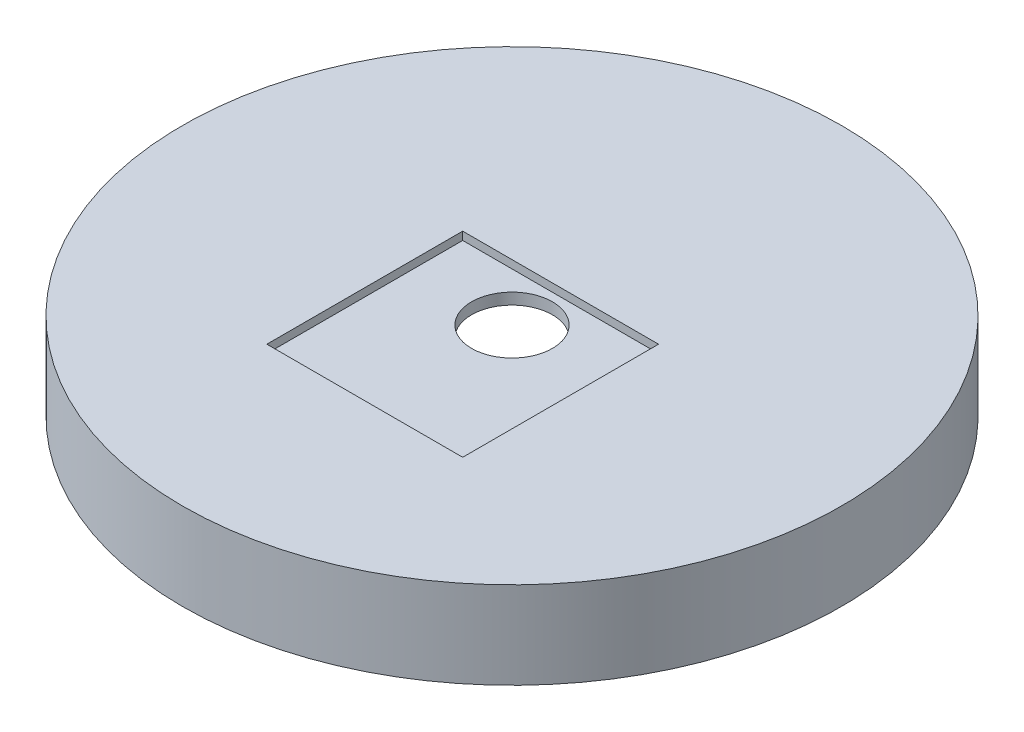
ISO-10303-21;
HEADER;
FILE_DESCRIPTION(('STEP AP214'),'2;1');
FILE_NAME('part.step','',(''),(''),'','','');
FILE_SCHEMA(('AUTOMOTIVE_DESIGN { 1 0 10303 214 1 1 1 1 }'));
ENDSEC;
DATA;
#1=APPLICATION_CONTEXT('core data for automotive mechanical design processes');
#2=APPLICATION_PROTOCOL_DEFINITION('international standard','automotive_design',2000,#1);
#3=PRODUCT_CONTEXT('',#1,'mechanical');
#4=PRODUCT('Part','Part','',(#3));
#5=PRODUCT_RELATED_PRODUCT_CATEGORY('part','',(#4));
#6=PRODUCT_DEFINITION_FORMATION('','',#4);
#7=PRODUCT_DEFINITION_CONTEXT('part definition',#1,'design');
#8=PRODUCT_DEFINITION('design','',#6,#7);
#9=PRODUCT_DEFINITION_SHAPE('','',#8);
#10=(LENGTH_UNIT() NAMED_UNIT(*) SI_UNIT(.MILLI.,.METRE.));
#11=(NAMED_UNIT(*) PLANE_ANGLE_UNIT() SI_UNIT($,.RADIAN.));
#12=(NAMED_UNIT(*) SI_UNIT($,.STERADIAN.) SOLID_ANGLE_UNIT());
#13=UNCERTAINTY_MEASURE_WITH_UNIT(LENGTH_MEASURE(1.E-05),#10,'distance_accuracy_value','');
#14=(GEOMETRIC_REPRESENTATION_CONTEXT(3) GLOBAL_UNCERTAINTY_ASSIGNED_CONTEXT((#13)) GLOBAL_UNIT_ASSIGNED_CONTEXT((#10,
#11,#12)) REPRESENTATION_CONTEXT('',''));
#15=CARTESIAN_POINT('',(0.,0.,0.));
#16=DIRECTION('',(0.,0.,1.));
#17=DIRECTION('',(1.,0.,0.));
#18=AXIS2_PLACEMENT_3D('',#15,#16,#17);
#19=CARTESIAN_POINT('',(0.,0.,0.));
#20=DIRECTION('',(0.,1.,0.));
#21=DIRECTION('',(0.,0.,1.));
#22=AXIS2_PLACEMENT_3D('',#19,#20,#21);
#23=CYLINDRICAL_SURFACE('',#22,3.25);
#24=CARTESIAN_POINT('',(0.,5.44285714285714,0.));
#25=DIRECTION('',(0.,1.,0.));
#26=DIRECTION('',(0.,0.,1.));
#27=AXIS2_PLACEMENT_3D('',#24,#25,#26);
#28=CIRCLE('',#27,3.25);
#29=CARTESIAN_POINT('',(0.,5.44285714285714,3.25));
#30=VERTEX_POINT('',#29);
#31=EDGE_CURVE('E111',#30,#30,#28,.T.);
#32=ORIENTED_EDGE('',*,*,#31,.F.);
#33=EDGE_LOOP('',(#32));
#34=FACE_BOUND('',#33,.T.);
#35=CARTESIAN_POINT('',(0.,6.35,0.));
#36=DIRECTION('',(0.,1.,0.));
#37=DIRECTION('',(0.,0.,1.));
#38=AXIS2_PLACEMENT_3D('',#35,#36,#37);
#39=CIRCLE('',#38,3.25);
#40=CARTESIAN_POINT('',(0.,6.35,3.25));
#41=VERTEX_POINT('',#40);
#42=EDGE_CURVE('E39',#41,#41,#39,.F.);
#43=ORIENTED_EDGE('',*,*,#42,.F.);
#44=EDGE_LOOP('',(#43));
#45=FACE_BOUND('',#44,.T.);
#46=ADVANCED_FACE('F35',(#34,#45),#23,.F.);
#47=CARTESIAN_POINT('',(22.,0.,0.));
#48=DIRECTION('',(0.,1.,0.));
#49=DIRECTION('',(0.,0.,1.));
#50=AXIS2_PLACEMENT_3D('',#47,#48,#49);
#51=PLANE('',#50);
#52=CARTESIAN_POINT('',(0.,0.,0.));
#53=DIRECTION('',(0.,1.,0.));
#54=DIRECTION('',(0.,0.,1.));
#55=AXIS2_PLACEMENT_3D('',#52,#53,#54);
#56=CIRCLE('',#55,26.5);
#57=CARTESIAN_POINT('',(0.,0.,26.5));
#58=VERTEX_POINT('',#57);
#59=EDGE_CURVE('E105',#58,#58,#56,.T.);
#60=ORIENTED_EDGE('',*,*,#59,.F.);
#61=EDGE_LOOP('',(#60));
#62=FACE_BOUND('',#61,.T.);
#63=CARTESIAN_POINT('',(0.,0.,0.));
#64=DIRECTION('',(0.,1.,0.));
#65=DIRECTION('',(0.,0.,1.));
#66=AXIS2_PLACEMENT_3D('',#63,#64,#65);
#67=CIRCLE('',#66,22.);
#68=CARTESIAN_POINT('',(0.,0.,22.));
#69=VERTEX_POINT('',#68);
#70=EDGE_CURVE('E114',#69,#69,#67,.T.);
#71=ORIENTED_EDGE('',*,*,#70,.T.);
#72=EDGE_LOOP('',(#71));
#73=FACE_BOUND('',#72,.T.);
#74=ADVANCED_FACE('F37',(#62,#73),#51,.F.);
#75=CARTESIAN_POINT('',(0.,5.44285714285714,0.));
#76=DIRECTION('',(0.,-1.,0.));
#77=DIRECTION('',(0.,0.,-1.));
#78=AXIS2_PLACEMENT_3D('',#75,#76,#77);
#79=CONICAL_SURFACE('',#78,3.25,1.28827537520932);
#80=ORIENTED_EDGE('',*,*,#70,.F.);
#81=EDGE_LOOP('',(#80));
#82=FACE_BOUND('',#81,.T.);
#83=ORIENTED_EDGE('',*,*,#31,.T.);
#84=EDGE_LOOP('',(#83));
#85=FACE_BOUND('',#84,.T.);
#86=ADVANCED_FACE('F143',(#82,#85),#79,.F.);
#87=CARTESIAN_POINT('',(26.5,7.,0.));
#88=DIRECTION('',(0.,-1.,0.));
#89=DIRECTION('',(0.,0.,-1.));
#90=AXIS2_PLACEMENT_3D('',#87,#88,#89);
#91=PLANE('',#90);
#92=DIRECTION('',(1.,0.,0.));
#93=VECTOR('',#92,1.);
#94=CARTESIAN_POINT('',(26.5,7.,-3.91));
#95=LINE('',#94,#93);
#96=CARTESIAN_POINT('',(-7.874,7.,-3.91));
#97=VERTEX_POINT('',#96);
#98=CARTESIAN_POINT('',(7.874,7.,-3.91));
#99=VERTEX_POINT('',#98);
#100=EDGE_CURVE('E117',#97,#99,#95,.T.);
#101=ORIENTED_EDGE('',*,*,#100,.T.);
#102=DIRECTION('',(0.,0.,1.));
#103=VECTOR('',#102,1.);
#104=CARTESIAN_POINT('',(7.874,7.,0.));
#105=LINE('',#104,#103);
#106=CARTESIAN_POINT('',(7.874,7.,11.838));
#107=VERTEX_POINT('',#106);
#108=EDGE_CURVE('E11',#99,#107,#105,.T.);
#109=ORIENTED_EDGE('',*,*,#108,.T.);
#110=DIRECTION('',(-1.,0.,0.));
#111=VECTOR('',#110,1.);
#112=CARTESIAN_POINT('',(26.5,7.,11.838));
#113=LINE('',#112,#111);
#114=CARTESIAN_POINT('',(-7.874,7.,11.838));
#115=VERTEX_POINT('',#114);
#116=EDGE_CURVE('E44',#107,#115,#113,.T.);
#117=ORIENTED_EDGE('',*,*,#116,.T.);
#118=DIRECTION('',(0.,0.,-1.));
#119=VECTOR('',#118,1.);
#120=CARTESIAN_POINT('',(-7.874,7.,0.));
#121=LINE('',#120,#119);
#122=EDGE_CURVE('E119',#115,#97,#121,.T.);
#123=ORIENTED_EDGE('',*,*,#122,.T.);
#124=EDGE_LOOP('',(#101,#109,#117,#123));
#125=FACE_BOUND('',#124,.T.);
#126=CARTESIAN_POINT('',(0.,7.,0.));
#127=DIRECTION('',(0.,1.,0.));
#128=DIRECTION('',(0.,0.,1.));
#129=AXIS2_PLACEMENT_3D('',#126,#127,#128);
#130=CIRCLE('',#129,26.5);
#131=CARTESIAN_POINT('',(0.,7.,26.5));
#132=VERTEX_POINT('',#131);
#133=EDGE_CURVE('E108',#132,#132,#130,.T.);
#134=ORIENTED_EDGE('',*,*,#133,.T.);
#135=EDGE_LOOP('',(#134));
#136=FACE_BOUND('',#135,.T.);
#137=ADVANCED_FACE('F123',(#125,#136),#91,.F.);
#138=CARTESIAN_POINT('',(0.,0.,0.));
#139=DIRECTION('',(0.,1.,0.));
#140=DIRECTION('',(0.,0.,1.));
#141=AXIS2_PLACEMENT_3D('',#138,#139,#140);
#142=CYLINDRICAL_SURFACE('',#141,26.5);
#143=ORIENTED_EDGE('',*,*,#133,.F.);
#144=EDGE_LOOP('',(#143));
#145=FACE_BOUND('',#144,.T.);
#146=ORIENTED_EDGE('',*,*,#59,.T.);
#147=EDGE_LOOP('',(#146));
#148=FACE_BOUND('',#147,.T.);
#149=ADVANCED_FACE('F154',(#145,#148),#142,.T.);
#150=CARTESIAN_POINT('',(0.,6.35,0.));
#151=DIRECTION('',(0.,1.,0.));
#152=DIRECTION('',(0.,0.,1.));
#153=AXIS2_PLACEMENT_3D('',#150,#151,#152);
#154=PLANE('',#153);
#155=DIRECTION('',(0.,0.,-1.));
#156=VECTOR('',#155,1.);
#157=CARTESIAN_POINT('',(7.874,6.35,11.838));
#158=LINE('',#157,#156);
#159=CARTESIAN_POINT('',(7.874,6.35,11.838));
#160=VERTEX_POINT('',#159);
#161=CARTESIAN_POINT('',(7.874,6.35,-3.91));
#162=VERTEX_POINT('',#161);
#163=EDGE_CURVE('E78',#160,#162,#158,.T.);
#164=ORIENTED_EDGE('',*,*,#163,.T.);
#165=DIRECTION('',(-1.,0.,0.));
#166=VECTOR('',#165,1.);
#167=CARTESIAN_POINT('',(7.874,6.35,-3.91));
#168=LINE('',#167,#166);
#169=CARTESIAN_POINT('',(-7.874,6.35,-3.91));
#170=VERTEX_POINT('',#169);
#171=EDGE_CURVE('E85',#162,#170,#168,.T.);
#172=ORIENTED_EDGE('',*,*,#171,.T.);
#173=DIRECTION('',(0.,0.,1.));
#174=VECTOR('',#173,1.);
#175=CARTESIAN_POINT('',(-7.874,6.35,-3.91));
#176=LINE('',#175,#174);
#177=CARTESIAN_POINT('',(-7.874,6.35,11.838));
#178=VERTEX_POINT('',#177);
#179=EDGE_CURVE('E91',#170,#178,#176,.T.);
#180=ORIENTED_EDGE('',*,*,#179,.T.);
#181=DIRECTION('',(1.,0.,0.));
#182=VECTOR('',#181,1.);
#183=CARTESIAN_POINT('',(-7.874,6.35,11.838));
#184=LINE('',#183,#182);
#185=EDGE_CURVE('E82',#178,#160,#184,.T.);
#186=ORIENTED_EDGE('',*,*,#185,.T.);
#187=EDGE_LOOP('',(#164,#172,#180,#186));
#188=FACE_BOUND('',#187,.T.);
#189=ORIENTED_EDGE('',*,*,#42,.T.);
#190=EDGE_LOOP('',(#189));
#191=FACE_BOUND('',#190,.T.);
#192=ADVANCED_FACE('F93',(#188,#191),#154,.T.);
#193=CARTESIAN_POINT('',(7.874,6.35,11.838));
#194=DIRECTION('',(1.,0.,0.));
#195=DIRECTION('',(0.,0.,-1.));
#196=AXIS2_PLACEMENT_3D('',#193,#194,#195);
#197=PLANE('',#196);
#198=DIRECTION('',(0.,1.,0.));
#199=VECTOR('',#198,1.);
#200=CARTESIAN_POINT('',(7.874,6.35,-3.91));
#201=LINE('',#200,#199);
#202=EDGE_CURVE('E51',#162,#99,#201,.T.);
#203=ORIENTED_EDGE('',*,*,#202,.F.);
#204=ORIENTED_EDGE('',*,*,#163,.F.);
#205=DIRECTION('',(0.,1.,0.));
#206=VECTOR('',#205,1.);
#207=CARTESIAN_POINT('',(7.874,6.35,11.838));
#208=LINE('',#207,#206);
#209=EDGE_CURVE('E100',#160,#107,#208,.T.);
#210=ORIENTED_EDGE('',*,*,#209,.T.);
#211=ORIENTED_EDGE('',*,*,#108,.F.);
#212=EDGE_LOOP('',(#203,#204,#210,#211));
#213=FACE_BOUND('',#212,.T.);
#214=ADVANCED_FACE('F76',(#213),#197,.F.);
#215=CARTESIAN_POINT('',(-7.874,6.35,11.838));
#216=DIRECTION('',(0.,0.,1.));
#217=DIRECTION('',(1.,0.,0.));
#218=AXIS2_PLACEMENT_3D('',#215,#216,#217);
#219=PLANE('',#218);
#220=ORIENTED_EDGE('',*,*,#209,.F.);
#221=ORIENTED_EDGE('',*,*,#185,.F.);
#222=DIRECTION('',(0.,1.,0.));
#223=VECTOR('',#222,1.);
#224=CARTESIAN_POINT('',(-7.874,6.35,11.838));
#225=LINE('',#224,#223);
#226=EDGE_CURVE('E102',#178,#115,#225,.T.);
#227=ORIENTED_EDGE('',*,*,#226,.T.);
#228=ORIENTED_EDGE('',*,*,#116,.F.);
#229=EDGE_LOOP('',(#220,#221,#227,#228));
#230=FACE_BOUND('',#229,.T.);
#231=ADVANCED_FACE('F127',(#230),#219,.F.);
#232=CARTESIAN_POINT('',(-7.874,6.35,-3.91));
#233=DIRECTION('',(-1.,0.,0.));
#234=DIRECTION('',(0.,0.,1.));
#235=AXIS2_PLACEMENT_3D('',#232,#233,#234);
#236=PLANE('',#235);
#237=ORIENTED_EDGE('',*,*,#226,.F.);
#238=ORIENTED_EDGE('',*,*,#179,.F.);
#239=DIRECTION('',(0.,1.,0.));
#240=VECTOR('',#239,1.);
#241=CARTESIAN_POINT('',(-7.874,6.35,-3.91));
#242=LINE('',#241,#240);
#243=EDGE_CURVE('E81',#170,#97,#242,.T.);
#244=ORIENTED_EDGE('',*,*,#243,.T.);
#245=ORIENTED_EDGE('',*,*,#122,.F.);
#246=EDGE_LOOP('',(#237,#238,#244,#245));
#247=FACE_BOUND('',#246,.T.);
#248=ADVANCED_FACE('F126',(#247),#236,.F.);
#249=CARTESIAN_POINT('',(7.874,6.35,-3.91));
#250=DIRECTION('',(0.,0.,-1.));
#251=DIRECTION('',(-1.,0.,0.));
#252=AXIS2_PLACEMENT_3D('',#249,#250,#251);
#253=PLANE('',#252);
#254=ORIENTED_EDGE('',*,*,#243,.F.);
#255=ORIENTED_EDGE('',*,*,#171,.F.);
#256=ORIENTED_EDGE('',*,*,#202,.T.);
#257=ORIENTED_EDGE('',*,*,#100,.F.);
#258=EDGE_LOOP('',(#254,#255,#256,#257));
#259=FACE_BOUND('',#258,.T.);
#260=ADVANCED_FACE('F86',(#259),#253,.F.);
#261=CLOSED_SHELL('',(#46,#74,#86,#137,#149,#192,#214,#231,#248,#260));
#262=MANIFOLD_SOLID_BREP('B2',#261);
#263=ADVANCED_BREP_SHAPE_REPRESENTATION('',(#18,#262),#14);
#264=SHAPE_DEFINITION_REPRESENTATION(#9,#263);
ENDSEC;
END-ISO-10303-21;
